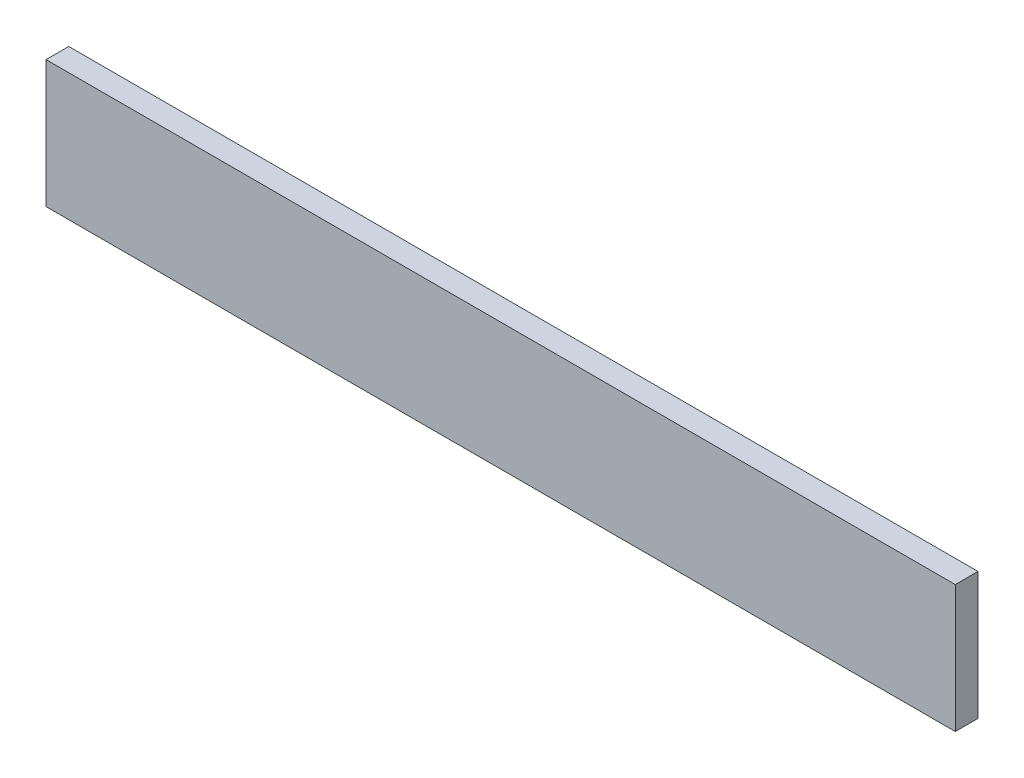
ISO-10303-21;
HEADER;
FILE_DESCRIPTION(('STEP AP214'),'2;1');
FILE_NAME('part.step','',(''),(''),'','','');
FILE_SCHEMA(('AUTOMOTIVE_DESIGN { 1 0 10303 214 1 1 1 1 }'));
ENDSEC;
DATA;
#1=APPLICATION_CONTEXT('core data for automotive mechanical design processes');
#2=APPLICATION_PROTOCOL_DEFINITION('international standard','automotive_design',2000,#1);
#3=PRODUCT_CONTEXT('',#1,'mechanical');
#4=PRODUCT('Part','Part','',(#3));
#5=PRODUCT_RELATED_PRODUCT_CATEGORY('part','',(#4));
#6=PRODUCT_DEFINITION_FORMATION('','',#4);
#7=PRODUCT_DEFINITION_CONTEXT('part definition',#1,'design');
#8=PRODUCT_DEFINITION('design','',#6,#7);
#9=PRODUCT_DEFINITION_SHAPE('','',#8);
#10=(LENGTH_UNIT() NAMED_UNIT(*) SI_UNIT(.MILLI.,.METRE.));
#11=(NAMED_UNIT(*) PLANE_ANGLE_UNIT() SI_UNIT($,.RADIAN.));
#12=(NAMED_UNIT(*) SI_UNIT($,.STERADIAN.) SOLID_ANGLE_UNIT());
#13=UNCERTAINTY_MEASURE_WITH_UNIT(LENGTH_MEASURE(1.E-05),#10,'distance_accuracy_value','');
#14=(GEOMETRIC_REPRESENTATION_CONTEXT(3) GLOBAL_UNCERTAINTY_ASSIGNED_CONTEXT((#13)) GLOBAL_UNIT_ASSIGNED_CONTEXT((#10,
#11,#12)) REPRESENTATION_CONTEXT('',''));
#15=CARTESIAN_POINT('',(0.,0.,0.));
#16=DIRECTION('',(0.,0.,1.));
#17=DIRECTION('',(1.,0.,0.));
#18=AXIS2_PLACEMENT_3D('',#15,#16,#17);
#19=CARTESIAN_POINT('',(63.5,-8.89,3.175));
#20=DIRECTION('',(-1.,0.,0.));
#21=DIRECTION('',(0.,0.,1.));
#22=AXIS2_PLACEMENT_3D('',#19,#20,#21);
#23=PLANE('',#22);
#24=DIRECTION('',(0.,1.,0.));
#25=VECTOR('',#24,1.);
#26=CARTESIAN_POINT('',(63.5,-8.89,0.));
#27=LINE('',#26,#25);
#28=CARTESIAN_POINT('',(63.5,-8.89,0.));
#29=VERTEX_POINT('',#28);
#30=CARTESIAN_POINT('',(63.5,8.89,0.));
#31=VERTEX_POINT('',#30);
#32=EDGE_CURVE('E96',#29,#31,#27,.T.);
#33=ORIENTED_EDGE('',*,*,#32,.T.);
#34=DIRECTION('',(0.,0.,-1.));
#35=VECTOR('',#34,1.);
#36=CARTESIAN_POINT('',(63.5,8.89,3.175));
#37=LINE('',#36,#35);
#38=CARTESIAN_POINT('',(63.5,8.89,3.175));
#39=VERTEX_POINT('',#38);
#40=EDGE_CURVE('E11',#39,#31,#37,.T.);
#41=ORIENTED_EDGE('',*,*,#40,.F.);
#42=DIRECTION('',(0.,1.,0.));
#43=VECTOR('',#42,1.);
#44=CARTESIAN_POINT('',(63.5,-8.89,3.175));
#45=LINE('',#44,#43);
#46=CARTESIAN_POINT('',(63.5,-8.89,3.175));
#47=VERTEX_POINT('',#46);
#48=EDGE_CURVE('E84',#47,#39,#45,.T.);
#49=ORIENTED_EDGE('',*,*,#48,.F.);
#50=DIRECTION('',(0.,0.,-1.));
#51=VECTOR('',#50,1.);
#52=CARTESIAN_POINT('',(63.5,-8.89,3.175));
#53=LINE('',#52,#51);
#54=EDGE_CURVE('E92',#47,#29,#53,.T.);
#55=ORIENTED_EDGE('',*,*,#54,.T.);
#56=EDGE_LOOP('',(#33,#41,#49,#55));
#57=FACE_BOUND('',#56,.T.);
#58=ADVANCED_FACE('F33',(#57),#23,.F.);
#59=CARTESIAN_POINT('',(-63.5,8.89,3.175));
#60=DIRECTION('',(0.,-1.,0.));
#61=DIRECTION('',(0.,0.,-1.));
#62=AXIS2_PLACEMENT_3D('',#59,#60,#61);
#63=PLANE('',#62);
#64=DIRECTION('',(-1.,0.,0.));
#65=VECTOR('',#64,1.);
#66=CARTESIAN_POINT('',(-63.5,8.89,0.));
#67=LINE('',#66,#65);
#68=CARTESIAN_POINT('',(-63.5,8.89,0.));
#69=VERTEX_POINT('',#68);
#70=EDGE_CURVE('E88',#31,#69,#67,.T.);
#71=ORIENTED_EDGE('',*,*,#70,.T.);
#72=DIRECTION('',(0.,0.,-1.));
#73=VECTOR('',#72,1.);
#74=CARTESIAN_POINT('',(-63.5,8.89,3.175));
#75=LINE('',#74,#73);
#76=CARTESIAN_POINT('',(-63.5,8.89,3.175));
#77=VERTEX_POINT('',#76);
#78=EDGE_CURVE('E41',#77,#69,#75,.T.);
#79=ORIENTED_EDGE('',*,*,#78,.F.);
#80=DIRECTION('',(-1.,0.,0.));
#81=VECTOR('',#80,1.);
#82=CARTESIAN_POINT('',(-63.5,8.89,3.175));
#83=LINE('',#82,#81);
#84=EDGE_CURVE('E79',#39,#77,#83,.T.);
#85=ORIENTED_EDGE('',*,*,#84,.F.);
#86=ORIENTED_EDGE('',*,*,#40,.T.);
#87=EDGE_LOOP('',(#71,#79,#85,#86));
#88=FACE_BOUND('',#87,.T.);
#89=ADVANCED_FACE('F87',(#88),#63,.F.);
#90=CARTESIAN_POINT('',(-63.5,-8.89,3.175));
#91=DIRECTION('',(1.,0.,0.));
#92=DIRECTION('',(0.,0.,-1.));
#93=AXIS2_PLACEMENT_3D('',#90,#91,#92);
#94=PLANE('',#93);
#95=DIRECTION('',(0.,-1.,0.));
#96=VECTOR('',#95,1.);
#97=CARTESIAN_POINT('',(-63.5,-8.89,0.));
#98=LINE('',#97,#96);
#99=CARTESIAN_POINT('',(-63.5,-8.89,0.));
#100=VERTEX_POINT('',#99);
#101=EDGE_CURVE('E66',#69,#100,#98,.T.);
#102=ORIENTED_EDGE('',*,*,#101,.T.);
#103=DIRECTION('',(0.,0.,-1.));
#104=VECTOR('',#103,1.);
#105=CARTESIAN_POINT('',(-63.5,-8.89,3.175));
#106=LINE('',#105,#104);
#107=CARTESIAN_POINT('',(-63.5,-8.89,3.175));
#108=VERTEX_POINT('',#107);
#109=EDGE_CURVE('E89',#108,#100,#106,.T.);
#110=ORIENTED_EDGE('',*,*,#109,.F.);
#111=DIRECTION('',(0.,-1.,0.));
#112=VECTOR('',#111,1.);
#113=CARTESIAN_POINT('',(-63.5,-8.89,3.175));
#114=LINE('',#113,#112);
#115=EDGE_CURVE('E82',#77,#108,#114,.T.);
#116=ORIENTED_EDGE('',*,*,#115,.F.);
#117=ORIENTED_EDGE('',*,*,#78,.T.);
#118=EDGE_LOOP('',(#102,#110,#116,#117));
#119=FACE_BOUND('',#118,.T.);
#120=ADVANCED_FACE('F90',(#119),#94,.F.);
#121=CARTESIAN_POINT('',(-63.5,-8.89,3.175));
#122=DIRECTION('',(0.,1.,0.));
#123=DIRECTION('',(0.,0.,1.));
#124=AXIS2_PLACEMENT_3D('',#121,#122,#123);
#125=PLANE('',#124);
#126=DIRECTION('',(1.,0.,0.));
#127=VECTOR('',#126,1.);
#128=CARTESIAN_POINT('',(-63.5,-8.89,0.));
#129=LINE('',#128,#127);
#130=EDGE_CURVE('E72',#100,#29,#129,.T.);
#131=ORIENTED_EDGE('',*,*,#130,.T.);
#132=ORIENTED_EDGE('',*,*,#54,.F.);
#133=DIRECTION('',(1.,0.,0.));
#134=VECTOR('',#133,1.);
#135=CARTESIAN_POINT('',(-63.5,-8.89,3.175));
#136=LINE('',#135,#134);
#137=EDGE_CURVE('E49',#108,#47,#136,.T.);
#138=ORIENTED_EDGE('',*,*,#137,.F.);
#139=ORIENTED_EDGE('',*,*,#109,.T.);
#140=EDGE_LOOP('',(#131,#132,#138,#139));
#141=FACE_BOUND('',#140,.T.);
#142=ADVANCED_FACE('F103',(#141),#125,.F.);
#143=CARTESIAN_POINT('',(0.,0.,3.175));
#144=DIRECTION('',(0.,0.,-1.));
#145=DIRECTION('',(-1.,0.,0.));
#146=AXIS2_PLACEMENT_3D('',#143,#144,#145);
#147=PLANE('',#146);
#148=ORIENTED_EDGE('',*,*,#48,.T.);
#149=ORIENTED_EDGE('',*,*,#84,.T.);
#150=ORIENTED_EDGE('',*,*,#115,.T.);
#151=ORIENTED_EDGE('',*,*,#137,.T.);
#152=EDGE_LOOP('',(#148,#149,#150,#151));
#153=FACE_BOUND('',#152,.T.);
#154=ADVANCED_FACE('F80',(#153),#147,.F.);
#155=CARTESIAN_POINT('',(0.,0.,0.));
#156=DIRECTION('',(0.,0.,-1.));
#157=DIRECTION('',(-1.,0.,0.));
#158=AXIS2_PLACEMENT_3D('',#155,#156,#157);
#159=PLANE('',#158);
#160=ORIENTED_EDGE('',*,*,#32,.F.);
#161=ORIENTED_EDGE('',*,*,#130,.F.);
#162=ORIENTED_EDGE('',*,*,#101,.F.);
#163=ORIENTED_EDGE('',*,*,#70,.F.);
#164=EDGE_LOOP('',(#160,#161,#162,#163));
#165=FACE_BOUND('',#164,.T.);
#166=ADVANCED_FACE('F106',(#165),#159,.T.);
#167=CLOSED_SHELL('',(#58,#89,#120,#142,#154,#166));
#168=MANIFOLD_SOLID_BREP('B2',#167);
#169=ADVANCED_BREP_SHAPE_REPRESENTATION('',(#18,#168),#14);
#170=SHAPE_DEFINITION_REPRESENTATION(#9,#169);
ENDSEC;
END-ISO-10303-21;
